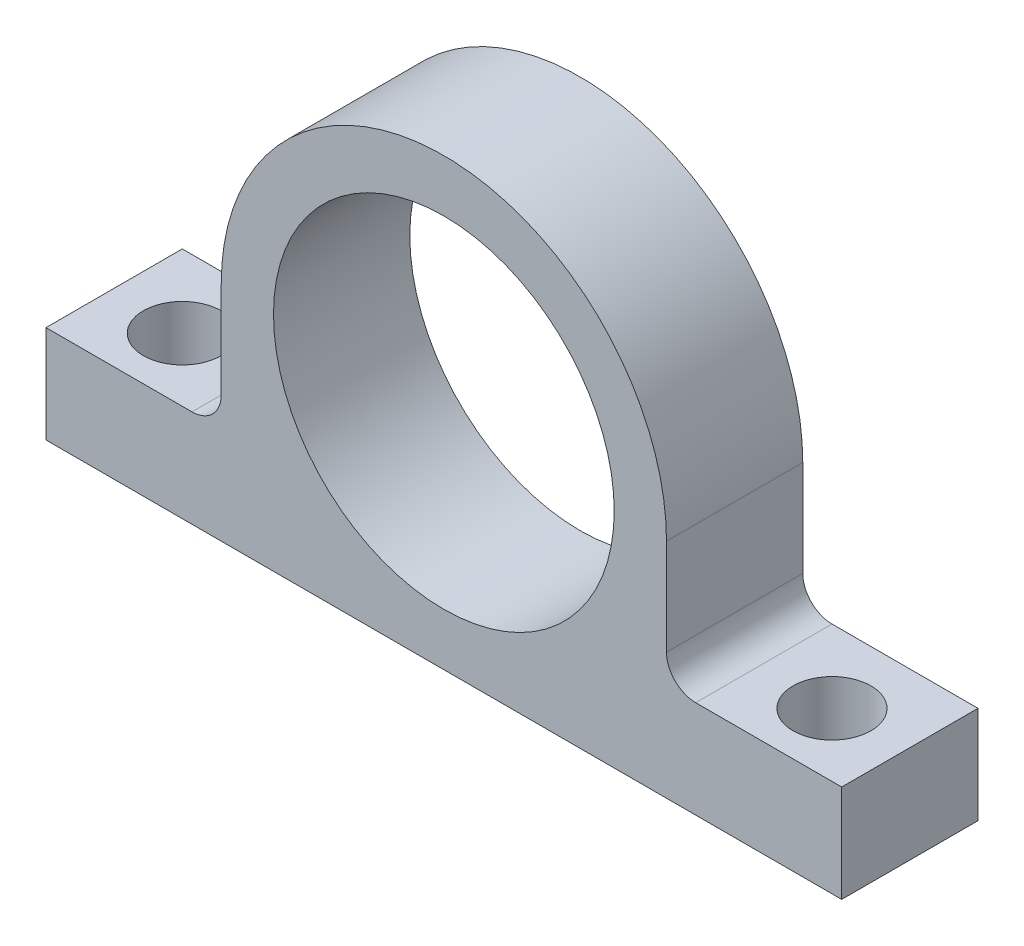
ISO-10303-21;
HEADER;
FILE_DESCRIPTION(('STEP AP214'),'2;1');
FILE_NAME('part.step','',(''),(''),'','','');
FILE_SCHEMA(('AUTOMOTIVE_DESIGN { 1 0 10303 214 1 1 1 1 }'));
ENDSEC;
DATA;
#1=APPLICATION_CONTEXT('core data for automotive mechanical design processes');
#2=APPLICATION_PROTOCOL_DEFINITION('international standard','automotive_design',2000,#1);
#3=PRODUCT_CONTEXT('',#1,'mechanical');
#4=PRODUCT('Part','Part','',(#3));
#5=PRODUCT_RELATED_PRODUCT_CATEGORY('part','',(#4));
#6=PRODUCT_DEFINITION_FORMATION('','',#4);
#7=PRODUCT_DEFINITION_CONTEXT('part definition',#1,'design');
#8=PRODUCT_DEFINITION('design','',#6,#7);
#9=PRODUCT_DEFINITION_SHAPE('','',#8);
#10=(LENGTH_UNIT() NAMED_UNIT(*) SI_UNIT(.MILLI.,.METRE.));
#11=(NAMED_UNIT(*) PLANE_ANGLE_UNIT() SI_UNIT($,.RADIAN.));
#12=(NAMED_UNIT(*) SI_UNIT($,.STERADIAN.) SOLID_ANGLE_UNIT());
#13=UNCERTAINTY_MEASURE_WITH_UNIT(LENGTH_MEASURE(1.E-05),#10,'distance_accuracy_value','');
#14=(GEOMETRIC_REPRESENTATION_CONTEXT(3) GLOBAL_UNCERTAINTY_ASSIGNED_CONTEXT((#13)) GLOBAL_UNIT_ASSIGNED_CONTEXT((#10,
#11,#12)) REPRESENTATION_CONTEXT('',''));
#15=CARTESIAN_POINT('',(0.,0.,0.));
#16=DIRECTION('',(0.,0.,1.));
#17=DIRECTION('',(1.,0.,0.));
#18=AXIS2_PLACEMENT_3D('',#15,#16,#17);
#19=CARTESIAN_POINT('',(-25.87,-9.87000000000001,14.));
#20=DIRECTION('',(0.,0.,1.));
#21=DIRECTION('',(1.,0.,0.));
#22=AXIS2_PLACEMENT_3D('',#19,#20,#21);
#23=PLANE('',#22);
#24=DIRECTION('',(0.,-1.,0.));
#25=VECTOR('',#24,1.);
#26=CARTESIAN_POINT('',(-40.87,-22.87,14.));
#27=LINE('',#26,#25);
#28=CARTESIAN_POINT('',(-40.87,-12.87,14.));
#29=VERTEX_POINT('',#28);
#30=CARTESIAN_POINT('',(-40.87,-22.87,14.));
#31=VERTEX_POINT('',#30);
#32=EDGE_CURVE('E182',#29,#31,#27,.T.);
#33=ORIENTED_EDGE('',*,*,#32,.T.);
#34=DIRECTION('',(1.,0.,0.));
#35=VECTOR('',#34,1.);
#36=CARTESIAN_POINT('',(40.87,-22.87,14.));
#37=LINE('',#36,#35);
#38=CARTESIAN_POINT('',(40.87,-22.87,14.));
#39=VERTEX_POINT('',#38);
#40=EDGE_CURVE('E106',#31,#39,#37,.T.);
#41=ORIENTED_EDGE('',*,*,#40,.T.);
#42=DIRECTION('',(0.,1.,0.));
#43=VECTOR('',#42,1.);
#44=CARTESIAN_POINT('',(40.87,-22.87,14.));
#45=LINE('',#44,#43);
#46=CARTESIAN_POINT('',(40.87,-12.87,14.));
#47=VERTEX_POINT('',#46);
#48=EDGE_CURVE('E211',#39,#47,#45,.T.);
#49=ORIENTED_EDGE('',*,*,#48,.T.);
#50=DIRECTION('',(-1.,0.,0.));
#51=VECTOR('',#50,1.);
#52=CARTESIAN_POINT('',(25.87,-12.87,14.));
#53=LINE('',#52,#51);
#54=CARTESIAN_POINT('',(25.87,-12.87,14.));
#55=VERTEX_POINT('',#54);
#56=EDGE_CURVE('E231',#47,#55,#53,.T.);
#57=ORIENTED_EDGE('',*,*,#56,.T.);
#58=CARTESIAN_POINT('',(25.87,-9.87000000000001,14.));
#59=DIRECTION('',(0.,0.,-1.));
#60=DIRECTION('',(-1.,0.,0.));
#61=AXIS2_PLACEMENT_3D('',#58,#59,#60);
#62=CIRCLE('',#61,3.);
#63=CARTESIAN_POINT('',(22.87,-9.87000000000001,14.));
#64=VERTEX_POINT('',#63);
#65=EDGE_CURVE('E227',#55,#64,#62,.T.);
#66=ORIENTED_EDGE('',*,*,#65,.T.);
#67=DIRECTION('',(0.,1.,0.));
#68=VECTOR('',#67,1.);
#69=CARTESIAN_POINT('',(22.87,0.,14.));
#70=LINE('',#69,#68);
#71=CARTESIAN_POINT('',(22.87,0.,14.));
#72=VERTEX_POINT('',#71);
#73=EDGE_CURVE('E230',#64,#72,#70,.T.);
#74=ORIENTED_EDGE('',*,*,#73,.T.);
#75=CARTESIAN_POINT('',(0.,0.,14.));
#76=DIRECTION('',(0.,0.,1.));
#77=DIRECTION('',(1.,0.,0.));
#78=AXIS2_PLACEMENT_3D('',#75,#76,#77);
#79=CIRCLE('',#78,22.87);
#80=CARTESIAN_POINT('',(-22.87,0.,14.));
#81=VERTEX_POINT('',#80);
#82=EDGE_CURVE('E131',#72,#81,#79,.T.);
#83=ORIENTED_EDGE('',*,*,#82,.T.);
#84=DIRECTION('',(0.,-1.,0.));
#85=VECTOR('',#84,1.);
#86=CARTESIAN_POINT('',(-22.87,0.,14.));
#87=LINE('',#86,#85);
#88=CARTESIAN_POINT('',(-22.87,-9.87000000000001,14.));
#89=VERTEX_POINT('',#88);
#90=EDGE_CURVE('E125',#81,#89,#87,.T.);
#91=ORIENTED_EDGE('',*,*,#90,.T.);
#92=CARTESIAN_POINT('',(-25.87,-9.87000000000001,14.));
#93=DIRECTION('',(0.,0.,-1.));
#94=DIRECTION('',(1.,0.,0.));
#95=AXIS2_PLACEMENT_3D('',#92,#93,#94);
#96=CIRCLE('',#95,3.);
#97=CARTESIAN_POINT('',(-25.87,-12.87,14.));
#98=VERTEX_POINT('',#97);
#99=EDGE_CURVE('E129',#89,#98,#96,.T.);
#100=ORIENTED_EDGE('',*,*,#99,.T.);
#101=DIRECTION('',(-1.,0.,0.));
#102=VECTOR('',#101,1.);
#103=CARTESIAN_POINT('',(-25.87,-12.87,14.));
#104=LINE('',#103,#102);
#105=EDGE_CURVE('E57',#98,#29,#104,.T.);
#106=ORIENTED_EDGE('',*,*,#105,.T.);
#107=EDGE_LOOP('',(#33,#41,#49,#57,#66,#74,#83,#91,#100,#106));
#108=FACE_BOUND('',#107,.T.);
#109=CARTESIAN_POINT('',(0.,0.,14.));
#110=DIRECTION('',(0.,0.,1.));
#111=DIRECTION('',(1.,0.,0.));
#112=AXIS2_PLACEMENT_3D('',#109,#110,#111);
#113=CIRCLE('',#112,17.5);
#114=CARTESIAN_POINT('',(17.5,0.,14.));
#115=VERTEX_POINT('',#114);
#116=EDGE_CURVE('E158',#115,#115,#113,.T.);
#117=ORIENTED_EDGE('',*,*,#116,.F.);
#118=EDGE_LOOP('',(#117));
#119=FACE_BOUND('',#118,.T.);
#120=ADVANCED_FACE('F39',(#108,#119),#23,.T.);
#121=CARTESIAN_POINT('',(-25.87,-9.87000000000001,0.));
#122=DIRECTION('',(0.,0.,1.));
#123=DIRECTION('',(1.,0.,0.));
#124=AXIS2_PLACEMENT_3D('',#121,#122,#123);
#125=PLANE('',#124);
#126=DIRECTION('',(0.,-1.,0.));
#127=VECTOR('',#126,1.);
#128=CARTESIAN_POINT('',(-40.87,-22.87,0.));
#129=LINE('',#128,#127);
#130=CARTESIAN_POINT('',(-40.87,-12.87,0.));
#131=VERTEX_POINT('',#130);
#132=CARTESIAN_POINT('',(-40.87,-22.87,0.));
#133=VERTEX_POINT('',#132);
#134=EDGE_CURVE('E153',#131,#133,#129,.T.);
#135=ORIENTED_EDGE('',*,*,#134,.F.);
#136=DIRECTION('',(-1.,0.,0.));
#137=VECTOR('',#136,1.);
#138=CARTESIAN_POINT('',(-25.87,-12.87,0.));
#139=LINE('',#138,#137);
#140=CARTESIAN_POINT('',(-25.87,-12.87,0.));
#141=VERTEX_POINT('',#140);
#142=EDGE_CURVE('E98',#141,#131,#139,.T.);
#143=ORIENTED_EDGE('',*,*,#142,.F.);
#144=CARTESIAN_POINT('',(-25.87,-9.87000000000001,0.));
#145=DIRECTION('',(0.,0.,-1.));
#146=DIRECTION('',(1.,0.,0.));
#147=AXIS2_PLACEMENT_3D('',#144,#145,#146);
#148=CIRCLE('',#147,3.);
#149=CARTESIAN_POINT('',(-22.87,-9.87000000000001,0.));
#150=VERTEX_POINT('',#149);
#151=EDGE_CURVE('E92',#150,#141,#148,.T.);
#152=ORIENTED_EDGE('',*,*,#151,.F.);
#153=DIRECTION('',(0.,-1.,0.));
#154=VECTOR('',#153,1.);
#155=CARTESIAN_POINT('',(-22.87,0.,0.));
#156=LINE('',#155,#154);
#157=CARTESIAN_POINT('',(-22.87,0.,0.));
#158=VERTEX_POINT('',#157);
#159=EDGE_CURVE('E140',#158,#150,#156,.T.);
#160=ORIENTED_EDGE('',*,*,#159,.F.);
#161=CARTESIAN_POINT('',(0.,0.,0.));
#162=DIRECTION('',(0.,0.,1.));
#163=DIRECTION('',(1.,0.,0.));
#164=AXIS2_PLACEMENT_3D('',#161,#162,#163);
#165=CIRCLE('',#164,22.87);
#166=CARTESIAN_POINT('',(22.87,0.,0.));
#167=VERTEX_POINT('',#166);
#168=EDGE_CURVE('E173',#167,#158,#165,.T.);
#169=ORIENTED_EDGE('',*,*,#168,.F.);
#170=DIRECTION('',(0.,1.,0.));
#171=VECTOR('',#170,1.);
#172=CARTESIAN_POINT('',(22.87,0.,0.));
#173=LINE('',#172,#171);
#174=CARTESIAN_POINT('',(22.87,-9.87000000000001,0.));
#175=VERTEX_POINT('',#174);
#176=EDGE_CURVE('E170',#175,#167,#173,.T.);
#177=ORIENTED_EDGE('',*,*,#176,.F.);
#178=CARTESIAN_POINT('',(25.87,-9.87000000000001,0.));
#179=DIRECTION('',(0.,0.,-1.));
#180=DIRECTION('',(-1.,0.,0.));
#181=AXIS2_PLACEMENT_3D('',#178,#179,#180);
#182=CIRCLE('',#181,3.);
#183=CARTESIAN_POINT('',(25.87,-12.87,0.));
#184=VERTEX_POINT('',#183);
#185=EDGE_CURVE('E167',#184,#175,#182,.T.);
#186=ORIENTED_EDGE('',*,*,#185,.F.);
#187=DIRECTION('',(-1.,0.,0.));
#188=VECTOR('',#187,1.);
#189=CARTESIAN_POINT('',(25.87,-12.87,0.));
#190=LINE('',#189,#188);
#191=CARTESIAN_POINT('',(40.87,-12.87,0.));
#192=VERTEX_POINT('',#191);
#193=EDGE_CURVE('E164',#192,#184,#190,.T.);
#194=ORIENTED_EDGE('',*,*,#193,.F.);
#195=DIRECTION('',(0.,1.,0.));
#196=VECTOR('',#195,1.);
#197=CARTESIAN_POINT('',(40.87,-22.87,0.));
#198=LINE('',#197,#196);
#199=CARTESIAN_POINT('',(40.87,-22.87,0.));
#200=VERTEX_POINT('',#199);
#201=EDGE_CURVE('E161',#200,#192,#198,.T.);
#202=ORIENTED_EDGE('',*,*,#201,.F.);
#203=DIRECTION('',(1.,0.,0.));
#204=VECTOR('',#203,1.);
#205=CARTESIAN_POINT('',(40.87,-22.87,0.));
#206=LINE('',#205,#204);
#207=EDGE_CURVE('E157',#133,#200,#206,.T.);
#208=ORIENTED_EDGE('',*,*,#207,.F.);
#209=EDGE_LOOP('',(#135,#143,#152,#160,#169,#177,#186,#194,#202,#208));
#210=FACE_BOUND('',#209,.T.);
#211=CARTESIAN_POINT('',(0.,0.,0.));
#212=DIRECTION('',(0.,0.,1.));
#213=DIRECTION('',(1.,0.,0.));
#214=AXIS2_PLACEMENT_3D('',#211,#212,#213);
#215=CIRCLE('',#214,17.5);
#216=CARTESIAN_POINT('',(17.5,0.,0.));
#217=VERTEX_POINT('',#216);
#218=EDGE_CURVE('E245',#217,#217,#215,.T.);
#219=ORIENTED_EDGE('',*,*,#218,.T.);
#220=EDGE_LOOP('',(#219));
#221=FACE_BOUND('',#220,.T.);
#222=ADVANCED_FACE('F215',(#210,#221),#125,.F.);
#223=CARTESIAN_POINT('',(-40.87,-22.87,14.));
#224=DIRECTION('',(1.,0.,0.));
#225=DIRECTION('',(0.,0.,-1.));
#226=AXIS2_PLACEMENT_3D('',#223,#224,#225);
#227=PLANE('',#226);
#228=ORIENTED_EDGE('',*,*,#134,.T.);
#229=DIRECTION('',(0.,0.,-1.));
#230=VECTOR('',#229,1.);
#231=CARTESIAN_POINT('',(-40.87,-22.87,14.));
#232=LINE('',#231,#230);
#233=EDGE_CURVE('E11',#31,#133,#232,.T.);
#234=ORIENTED_EDGE('',*,*,#233,.F.);
#235=ORIENTED_EDGE('',*,*,#32,.F.);
#236=DIRECTION('',(0.,0.,-1.));
#237=VECTOR('',#236,1.);
#238=CARTESIAN_POINT('',(-40.87,-12.87,14.));
#239=LINE('',#238,#237);
#240=EDGE_CURVE('E149',#29,#131,#239,.T.);
#241=ORIENTED_EDGE('',*,*,#240,.T.);
#242=EDGE_LOOP('',(#228,#234,#235,#241));
#243=FACE_BOUND('',#242,.T.);
#244=ADVANCED_FACE('F41',(#243),#227,.F.);
#245=CARTESIAN_POINT('',(40.87,-22.87,14.));
#246=DIRECTION('',(0.,1.,0.));
#247=DIRECTION('',(0.,0.,1.));
#248=AXIS2_PLACEMENT_3D('',#245,#246,#247);
#249=PLANE('',#248);
#250=CARTESIAN_POINT('',(-33.37,-22.87,7.5));
#251=DIRECTION('',(0.,-1.,0.));
#252=DIRECTION('',(0.,0.,1.));
#253=AXIS2_PLACEMENT_3D('',#250,#251,#252);
#254=CIRCLE('',#253,4.);
#255=CARTESIAN_POINT('',(-33.37,-22.87,11.5));
#256=VERTEX_POINT('',#255);
#257=EDGE_CURVE('E257',#256,#256,#254,.T.);
#258=ORIENTED_EDGE('',*,*,#257,.F.);
#259=EDGE_LOOP('',(#258));
#260=FACE_BOUND('',#259,.T.);
#261=CARTESIAN_POINT('',(33.37,-22.87,7.5));
#262=DIRECTION('',(0.,1.,0.));
#263=DIRECTION('',(0.,0.,1.));
#264=AXIS2_PLACEMENT_3D('',#261,#262,#263);
#265=CIRCLE('',#264,4.);
#266=CARTESIAN_POINT('',(33.37,-22.87,11.5));
#267=VERTEX_POINT('',#266);
#268=EDGE_CURVE('E249',#267,#267,#265,.T.);
#269=ORIENTED_EDGE('',*,*,#268,.T.);
#270=EDGE_LOOP('',(#269));
#271=FACE_BOUND('',#270,.T.);
#272=ORIENTED_EDGE('',*,*,#207,.T.);
#273=DIRECTION('',(0.,0.,-1.));
#274=VECTOR('',#273,1.);
#275=CARTESIAN_POINT('',(40.87,-22.87,14.));
#276=LINE('',#275,#274);
#277=EDGE_CURVE('E49',#39,#200,#276,.T.);
#278=ORIENTED_EDGE('',*,*,#277,.F.);
#279=ORIENTED_EDGE('',*,*,#40,.F.);
#280=ORIENTED_EDGE('',*,*,#233,.T.);
#281=EDGE_LOOP('',(#272,#278,#279,#280));
#282=FACE_BOUND('',#281,.T.);
#283=ADVANCED_FACE('F272',(#260,#271,#282),#249,.F.);
#284=CARTESIAN_POINT('',(40.87,-22.87,14.));
#285=DIRECTION('',(-1.,0.,0.));
#286=DIRECTION('',(0.,0.,1.));
#287=AXIS2_PLACEMENT_3D('',#284,#285,#286);
#288=PLANE('',#287);
#289=ORIENTED_EDGE('',*,*,#201,.T.);
#290=DIRECTION('',(0.,0.,-1.));
#291=VECTOR('',#290,1.);
#292=CARTESIAN_POINT('',(40.87,-12.87,14.));
#293=LINE('',#292,#291);
#294=EDGE_CURVE('E201',#47,#192,#293,.T.);
#295=ORIENTED_EDGE('',*,*,#294,.F.);
#296=ORIENTED_EDGE('',*,*,#48,.F.);
#297=ORIENTED_EDGE('',*,*,#277,.T.);
#298=EDGE_LOOP('',(#289,#295,#296,#297));
#299=FACE_BOUND('',#298,.T.);
#300=ADVANCED_FACE('F209',(#299),#288,.F.);
#301=CARTESIAN_POINT('',(25.87,-12.87,14.));
#302=DIRECTION('',(0.,-1.,0.));
#303=DIRECTION('',(1.,0.,0.));
#304=AXIS2_PLACEMENT_3D('',#301,#302,#303);
#305=PLANE('',#304);
#306=CARTESIAN_POINT('',(33.37,-12.87,7.5));
#307=DIRECTION('',(0.,1.,0.));
#308=DIRECTION('',(0.,0.,1.));
#309=AXIS2_PLACEMENT_3D('',#306,#307,#308);
#310=CIRCLE('',#309,4.);
#311=CARTESIAN_POINT('',(33.37,-12.87,11.5));
#312=VERTEX_POINT('',#311);
#313=EDGE_CURVE('E253',#312,#312,#310,.T.);
#314=ORIENTED_EDGE('',*,*,#313,.F.);
#315=EDGE_LOOP('',(#314));
#316=FACE_BOUND('',#315,.T.);
#317=ORIENTED_EDGE('',*,*,#193,.T.);
#318=DIRECTION('',(0.,0.,-1.));
#319=VECTOR('',#318,1.);
#320=CARTESIAN_POINT('',(25.87,-12.87,14.));
#321=LINE('',#320,#319);
#322=EDGE_CURVE('E197',#55,#184,#321,.T.);
#323=ORIENTED_EDGE('',*,*,#322,.F.);
#324=ORIENTED_EDGE('',*,*,#56,.F.);
#325=ORIENTED_EDGE('',*,*,#294,.T.);
#326=EDGE_LOOP('',(#317,#323,#324,#325));
#327=FACE_BOUND('',#326,.T.);
#328=ADVANCED_FACE('F221',(#316,#327),#305,.F.);
#329=CARTESIAN_POINT('',(25.87,-9.87000000000001,14.));
#330=DIRECTION('',(0.,0.,-1.));
#331=DIRECTION('',(-1.,0.,0.));
#332=AXIS2_PLACEMENT_3D('',#329,#330,#331);
#333=CYLINDRICAL_SURFACE('',#332,3.);
#334=ORIENTED_EDGE('',*,*,#185,.T.);
#335=DIRECTION('',(0.,0.,-1.));
#336=VECTOR('',#335,1.);
#337=CARTESIAN_POINT('',(22.87,-9.87000000000001,14.));
#338=LINE('',#337,#336);
#339=EDGE_CURVE('E193',#64,#175,#338,.T.);
#340=ORIENTED_EDGE('',*,*,#339,.F.);
#341=ORIENTED_EDGE('',*,*,#65,.F.);
#342=ORIENTED_EDGE('',*,*,#322,.T.);
#343=EDGE_LOOP('',(#334,#340,#341,#342));
#344=FACE_BOUND('',#343,.T.);
#345=ADVANCED_FACE('F225',(#344),#333,.F.);
#346=CARTESIAN_POINT('',(22.87,0.,14.));
#347=DIRECTION('',(-1.,0.,0.));
#348=DIRECTION('',(0.,-1.,0.));
#349=AXIS2_PLACEMENT_3D('',#346,#347,#348);
#350=PLANE('',#349);
#351=ORIENTED_EDGE('',*,*,#176,.T.);
#352=DIRECTION('',(0.,0.,-1.));
#353=VECTOR('',#352,1.);
#354=CARTESIAN_POINT('',(22.87,0.,14.));
#355=LINE('',#354,#353);
#356=EDGE_CURVE('E189',#72,#167,#355,.T.);
#357=ORIENTED_EDGE('',*,*,#356,.F.);
#358=ORIENTED_EDGE('',*,*,#73,.F.);
#359=ORIENTED_EDGE('',*,*,#339,.T.);
#360=EDGE_LOOP('',(#351,#357,#358,#359));
#361=FACE_BOUND('',#360,.T.);
#362=ADVANCED_FACE('F284',(#361),#350,.F.);
#363=CARTESIAN_POINT('',(0.,0.,14.));
#364=DIRECTION('',(0.,0.,-1.));
#365=DIRECTION('',(-1.,0.,0.));
#366=AXIS2_PLACEMENT_3D('',#363,#364,#365);
#367=CYLINDRICAL_SURFACE('',#366,22.87);
#368=ORIENTED_EDGE('',*,*,#168,.T.);
#369=DIRECTION('',(0.,0.,-1.));
#370=VECTOR('',#369,1.);
#371=CARTESIAN_POINT('',(-22.87,0.,14.));
#372=LINE('',#371,#370);
#373=EDGE_CURVE('E142',#81,#158,#372,.T.);
#374=ORIENTED_EDGE('',*,*,#373,.F.);
#375=ORIENTED_EDGE('',*,*,#82,.F.);
#376=ORIENTED_EDGE('',*,*,#356,.T.);
#377=EDGE_LOOP('',(#368,#374,#375,#376));
#378=FACE_BOUND('',#377,.T.);
#379=ADVANCED_FACE('F281',(#378),#367,.T.);
#380=CARTESIAN_POINT('',(-22.87,0.,14.));
#381=DIRECTION('',(1.,0.,0.));
#382=DIRECTION('',(0.,1.,0.));
#383=AXIS2_PLACEMENT_3D('',#380,#381,#382);
#384=PLANE('',#383);
#385=ORIENTED_EDGE('',*,*,#159,.T.);
#386=DIRECTION('',(0.,0.,-1.));
#387=VECTOR('',#386,1.);
#388=CARTESIAN_POINT('',(-22.87,-9.87000000000001,14.));
#389=LINE('',#388,#387);
#390=EDGE_CURVE('E137',#89,#150,#389,.T.);
#391=ORIENTED_EDGE('',*,*,#390,.F.);
#392=ORIENTED_EDGE('',*,*,#90,.F.);
#393=ORIENTED_EDGE('',*,*,#373,.T.);
#394=EDGE_LOOP('',(#385,#391,#392,#393));
#395=FACE_BOUND('',#394,.T.);
#396=ADVANCED_FACE('F138',(#395),#384,.F.);
#397=CARTESIAN_POINT('',(-25.87,-9.87000000000001,14.));
#398=DIRECTION('',(0.,0.,-1.));
#399=DIRECTION('',(-1.,0.,0.));
#400=AXIS2_PLACEMENT_3D('',#397,#398,#399);
#401=CYLINDRICAL_SURFACE('',#400,3.);
#402=ORIENTED_EDGE('',*,*,#151,.T.);
#403=DIRECTION('',(0.,0.,-1.));
#404=VECTOR('',#403,1.);
#405=CARTESIAN_POINT('',(-25.87,-12.87,14.));
#406=LINE('',#405,#404);
#407=EDGE_CURVE('E143',#98,#141,#406,.T.);
#408=ORIENTED_EDGE('',*,*,#407,.F.);
#409=ORIENTED_EDGE('',*,*,#99,.F.);
#410=ORIENTED_EDGE('',*,*,#390,.T.);
#411=EDGE_LOOP('',(#402,#408,#409,#410));
#412=FACE_BOUND('',#411,.T.);
#413=ADVANCED_FACE('F145',(#412),#401,.F.);
#414=CARTESIAN_POINT('',(-25.87,-12.87,14.));
#415=DIRECTION('',(0.,-1.,0.));
#416=DIRECTION('',(1.,0.,0.));
#417=AXIS2_PLACEMENT_3D('',#414,#415,#416);
#418=PLANE('',#417);
#419=CARTESIAN_POINT('',(-33.37,-12.87,7.5));
#420=DIRECTION('',(0.,-1.,0.));
#421=DIRECTION('',(0.,0.,1.));
#422=AXIS2_PLACEMENT_3D('',#419,#420,#421);
#423=CIRCLE('',#422,4.);
#424=CARTESIAN_POINT('',(-33.37,-12.87,11.5));
#425=VERTEX_POINT('',#424);
#426=EDGE_CURVE('E261',#425,#425,#423,.T.);
#427=ORIENTED_EDGE('',*,*,#426,.T.);
#428=EDGE_LOOP('',(#427));
#429=FACE_BOUND('',#428,.T.);
#430=ORIENTED_EDGE('',*,*,#142,.T.);
#431=ORIENTED_EDGE('',*,*,#240,.F.);
#432=ORIENTED_EDGE('',*,*,#105,.F.);
#433=ORIENTED_EDGE('',*,*,#407,.T.);
#434=EDGE_LOOP('',(#430,#431,#432,#433));
#435=FACE_BOUND('',#434,.T.);
#436=ADVANCED_FACE('F303',(#429,#435),#418,.F.);
#437=CARTESIAN_POINT('',(0.,0.,14.));
#438=DIRECTION('',(0.,0.,-1.));
#439=DIRECTION('',(-1.,0.,0.));
#440=AXIS2_PLACEMENT_3D('',#437,#438,#439);
#441=CYLINDRICAL_SURFACE('',#440,17.5);
#442=ORIENTED_EDGE('',*,*,#116,.T.);
#443=EDGE_LOOP('',(#442));
#444=FACE_BOUND('',#443,.T.);
#445=ORIENTED_EDGE('',*,*,#218,.F.);
#446=EDGE_LOOP('',(#445));
#447=FACE_BOUND('',#446,.T.);
#448=ADVANCED_FACE('F300',(#444,#447),#441,.F.);
#449=CARTESIAN_POINT('',(33.37,-22.87,7.5));
#450=DIRECTION('',(0.,1.,0.));
#451=DIRECTION('',(0.,0.,1.));
#452=AXIS2_PLACEMENT_3D('',#449,#450,#451);
#453=CYLINDRICAL_SURFACE('',#452,4.);
#454=ORIENTED_EDGE('',*,*,#268,.F.);
#455=EDGE_LOOP('',(#454));
#456=FACE_BOUND('',#455,.T.);
#457=ORIENTED_EDGE('',*,*,#313,.T.);
#458=EDGE_LOOP('',(#457));
#459=FACE_BOUND('',#458,.T.);
#460=ADVANCED_FACE('F330',(#456,#459),#453,.F.);
#461=CARTESIAN_POINT('',(-33.37,-22.87,7.5));
#462=DIRECTION('',(0.,1.,0.));
#463=DIRECTION('',(0.,0.,1.));
#464=AXIS2_PLACEMENT_3D('',#461,#462,#463);
#465=CYLINDRICAL_SURFACE('',#464,4.);
#466=ORIENTED_EDGE('',*,*,#257,.T.);
#467=EDGE_LOOP('',(#466));
#468=FACE_BOUND('',#467,.T.);
#469=ORIENTED_EDGE('',*,*,#426,.F.);
#470=EDGE_LOOP('',(#469));
#471=FACE_BOUND('',#470,.T.);
#472=ADVANCED_FACE('F269',(#468,#471),#465,.F.);
#473=CLOSED_SHELL('',(#120,#222,#244,#283,#300,#328,#345,#362,#379,#396,#413,#436,#448,#460,#472));
#474=MANIFOLD_SOLID_BREP('B2',#473);
#475=ADVANCED_BREP_SHAPE_REPRESENTATION('',(#18,#474),#14);
#476=SHAPE_DEFINITION_REPRESENTATION(#9,#475);
ENDSEC;
END-ISO-10303-21;
